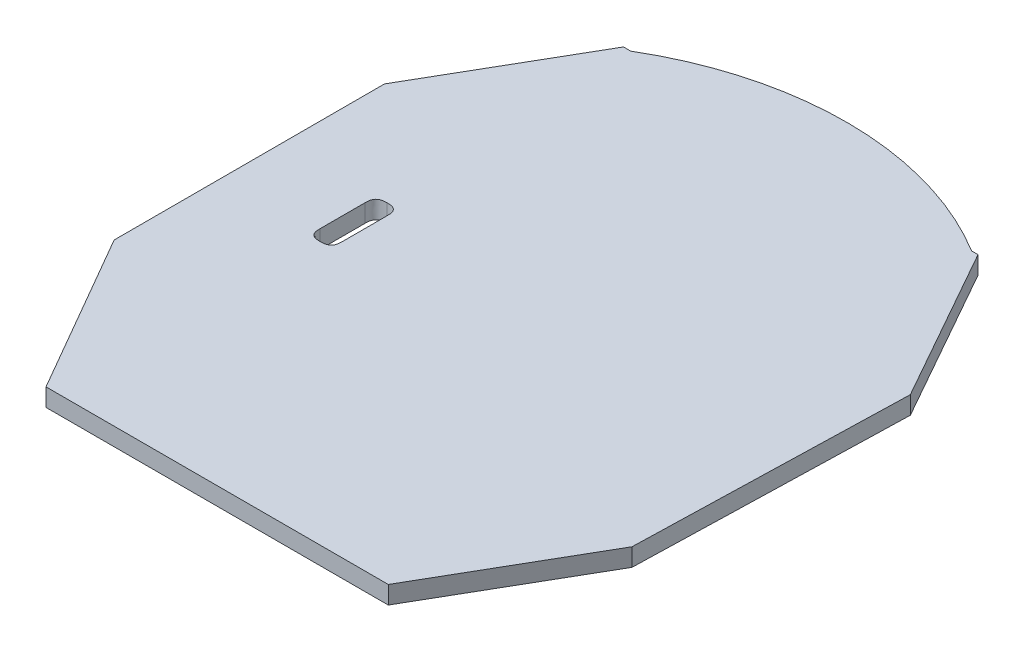
ISO-10303-21;
HEADER;
FILE_DESCRIPTION(('STEP AP214'),'2;1');
FILE_NAME('part.step','',(''),(''),'','','');
FILE_SCHEMA(('AUTOMOTIVE_DESIGN { 1 0 10303 214 1 1 1 1 }'));
ENDSEC;
DATA;
#1=APPLICATION_CONTEXT('core data for automotive mechanical design processes');
#2=APPLICATION_PROTOCOL_DEFINITION('international standard','automotive_design',2000,#1);
#3=PRODUCT_CONTEXT('',#1,'mechanical');
#4=PRODUCT('Part','Part','',(#3));
#5=PRODUCT_RELATED_PRODUCT_CATEGORY('part','',(#4));
#6=PRODUCT_DEFINITION_FORMATION('','',#4);
#7=PRODUCT_DEFINITION_CONTEXT('part definition',#1,'design');
#8=PRODUCT_DEFINITION('design','',#6,#7);
#9=PRODUCT_DEFINITION_SHAPE('','',#8);
#10=(LENGTH_UNIT() NAMED_UNIT(*) SI_UNIT(.MILLI.,.METRE.));
#11=(NAMED_UNIT(*) PLANE_ANGLE_UNIT() SI_UNIT($,.RADIAN.));
#12=(NAMED_UNIT(*) SI_UNIT($,.STERADIAN.) SOLID_ANGLE_UNIT());
#13=UNCERTAINTY_MEASURE_WITH_UNIT(LENGTH_MEASURE(1.E-05),#10,'distance_accuracy_value','');
#14=(GEOMETRIC_REPRESENTATION_CONTEXT(3) GLOBAL_UNCERTAINTY_ASSIGNED_CONTEXT((#13)) GLOBAL_UNIT_ASSIGNED_CONTEXT((#10,
#11,#12)) REPRESENTATION_CONTEXT('',''));
#15=CARTESIAN_POINT('',(0.,0.,0.));
#16=DIRECTION('',(0.,0.,1.));
#17=DIRECTION('',(1.,0.,0.));
#18=AXIS2_PLACEMENT_3D('',#15,#16,#17);
#19=CARTESIAN_POINT('',(-100.196877436676,1.6,22.504325219327));
#20=DIRECTION('',(0.,-1.,0.));
#21=DIRECTION('',(0.,0.,-1.));
#22=AXIS2_PLACEMENT_3D('',#19,#20,#21);
#23=PLANE('',#22);
#24=DIRECTION('',(-0.5,0.,0.866025403784438));
#25=VECTOR('',#24,1.);
#26=CARTESIAN_POINT('',(-123.876706844463,1.6,10.3933670259679));
#27=LINE('',#26,#25);
#28=CARTESIAN_POINT('',(-116.035748856696,1.6,-3.18757058885886));
#29=VERTEX_POINT('',#28);
#30=CARTESIAN_POINT('',(-123.876706844463,1.6,10.3933670259679));
#31=VERTEX_POINT('',#30);
#32=EDGE_CURVE('E165',#29,#31,#27,.T.);
#33=ORIENTED_EDGE('',*,*,#32,.T.);
#34=DIRECTION('',(0.,0.,1.));
#35=VECTOR('',#34,1.);
#36=CARTESIAN_POINT('',(-123.876706844463,1.6,10.3933670259679));
#37=LINE('',#36,#35);
#38=CARTESIAN_POINT('',(-123.876706844463,1.6,34.615283412686));
#39=VERTEX_POINT('',#38);
#40=EDGE_CURVE('E154',#31,#39,#37,.T.);
#41=ORIENTED_EDGE('',*,*,#40,.T.);
#42=DIRECTION('',(0.5,0.,0.866025403784439));
#43=VECTOR('',#42,1.);
#44=CARTESIAN_POINT('',(-123.876706844463,1.6,34.615283412686));
#45=LINE('',#44,#43);
#46=CARTESIAN_POINT('',(-115.532924627112,1.6,49.0671381404276));
#47=VERTEX_POINT('',#46);
#48=EDGE_CURVE('E164',#39,#47,#45,.T.);
#49=ORIENTED_EDGE('',*,*,#48,.T.);
#50=DIRECTION('',(1.,0.,0.));
#51=VECTOR('',#50,1.);
#52=CARTESIAN_POINT('',(-115.532924627112,1.6,49.0671381404276));
#53=LINE('',#52,#51);
#54=CARTESIAN_POINT('',(-84.8608302462487,1.6,49.0671381404276));
#55=VERTEX_POINT('',#54);
#56=EDGE_CURVE('E199',#47,#55,#53,.T.);
#57=ORIENTED_EDGE('',*,*,#56,.T.);
#58=DIRECTION('',(0.5,0.,-0.866025403784439));
#59=VECTOR('',#58,1.);
#60=CARTESIAN_POINT('',(-84.8608302462487,1.6,49.0671381404276));
#61=LINE('',#60,#59);
#62=CARTESIAN_POINT('',(-76.8670067353805,1.6,35.2214296728651));
#63=VERTEX_POINT('',#62);
#64=EDGE_CURVE('E201',#55,#63,#61,.T.);
#65=ORIENTED_EDGE('',*,*,#64,.T.);
#66=DIRECTION('',(0.0275068408451087,0.,-0.999621615265857));
#67=VECTOR('',#66,1.);
#68=CARTESIAN_POINT('',(-76.8670067353805,1.6,35.2214296728651));
#69=LINE('',#68,#67);
#70=CARTESIAN_POINT('',(-76.1989592195925,1.6,10.9440238970924));
#71=VERTEX_POINT('',#70);
#72=EDGE_CURVE('E203',#63,#71,#69,.T.);
#73=ORIENTED_EDGE('',*,*,#72,.T.);
#74=DIRECTION('',(-0.491106131302263,0.,-0.871099746181414));
#75=VECTOR('',#74,1.);
#76=CARTESIAN_POINT('',(-84.0333826596673,1.6,-2.95228860063641));
#77=LINE('',#76,#75);
#78=CARTESIAN_POINT('',(-84.0333826596673,1.6,-2.95228860063641));
#79=VERTEX_POINT('',#78);
#80=EDGE_CURVE('E205',#71,#79,#77,.T.);
#81=ORIENTED_EDGE('',*,*,#80,.T.);
#82=DIRECTION('',(-0.999972975007576,0.,-0.00735181980857839));
#83=VECTOR('',#82,1.);
#84=CARTESIAN_POINT('',(-84.6159522411419,1.6,-2.9565716629751));
#85=LINE('',#84,#83);
#86=CARTESIAN_POINT('',(-84.6159522411419,1.6,-2.9565716629751));
#87=VERTEX_POINT('',#86);
#88=EDGE_CURVE('E207',#79,#87,#85,.T.);
#89=ORIENTED_EDGE('',*,*,#88,.T.);
#90=CARTESIAN_POINT('',(-100.196877436676,1.6,22.504325219327));
#91=DIRECTION('',(0.,1.,0.));
#92=DIRECTION('',(0.,0.,-1.));
#93=AXIS2_PLACEMENT_3D('',#90,#91,#92);
#94=CIRCLE('',#93,29.8500000000009);
#95=CARTESIAN_POINT('',(-115.40176062263,1.6,-3.18290949563525));
#96=VERTEX_POINT('',#95);
#97=EDGE_CURVE('E209',#87,#96,#94,.T.);
#98=ORIENTED_EDGE('',*,*,#97,.T.);
#99=DIRECTION('',(-0.999972975007576,0.,-0.00735181980855867));
#100=VECTOR('',#99,1.);
#101=CARTESIAN_POINT('',(-116.035748856696,1.6,-3.18757058885886));
#102=LINE('',#101,#100);
#103=EDGE_CURVE('E169',#96,#29,#102,.T.);
#104=ORIENTED_EDGE('',*,*,#103,.T.);
#105=EDGE_LOOP('',(#33,#41,#49,#57,#65,#73,#81,#89,#98,#104));
#106=FACE_BOUND('',#105,.T.);
#107=DIRECTION('',(0.,0.,1.));
#108=VECTOR('',#107,1.);
#109=CARTESIAN_POINT('',(-115.526706844463,1.6,19.504325219327));
#110=LINE('',#109,#108);
#111=CARTESIAN_POINT('',(-115.526706844463,1.6,20.504325219327));
#112=VERTEX_POINT('',#111);
#113=CARTESIAN_POINT('',(-115.526706844463,1.6,24.504325219327));
#114=VERTEX_POINT('',#113);
#115=EDGE_CURVE('E189',#112,#114,#110,.T.);
#116=ORIENTED_EDGE('',*,*,#115,.F.);
#117=CARTESIAN_POINT('',(-114.526706844463,1.6,19.504325219327));
#118=CARTESIAN_POINT('',(-114.694904895997,1.6,19.504325219327));
#119=CARTESIAN_POINT('',(-114.863102947531,1.6,19.504325219327));
#120=CARTESIAN_POINT('',(-115.23381362565,1.6,19.576017139163));
#121=CARTESIAN_POINT('',(-115.455014924627,1.6,19.7972184381404));
#122=CARTESIAN_POINT('',(-115.526706844463,1.6,20.1679291162591));
#123=CARTESIAN_POINT('',(-115.526706844463,1.6,20.336127167793));
#124=CARTESIAN_POINT('',(-115.526706844463,1.6,20.504325219327));
#125=B_SPLINE_CURVE_WITH_KNOTS('',5,(#117,#118,#119,#120,#121,#122,#123,#124),.UNSPECIFIED.,.F.,
.F.,(6,2,6),(0.,0.5,1.),.UNSPECIFIED.);
#126=CARTESIAN_POINT('',(-114.526706844463,1.6,19.504325219327));
#127=VERTEX_POINT('',#126);
#128=EDGE_CURVE('E11',#112,#127,#125,.F.);
#129=ORIENTED_EDGE('',*,*,#128,.T.);
#130=CARTESIAN_POINT('',(-113.526706844463,1.6,20.504325219327));
#131=CARTESIAN_POINT('',(-113.526706844463,1.6,20.336127167793));
#132=CARTESIAN_POINT('',(-113.526706844463,1.6,20.1679291162591));
#133=CARTESIAN_POINT('',(-113.598398764299,1.6,19.7972184381404));
#134=CARTESIAN_POINT('',(-113.819600063277,1.6,19.576017139163));
#135=CARTESIAN_POINT('',(-114.190310741395,1.6,19.504325219327));
#136=CARTESIAN_POINT('',(-114.358508792929,1.6,19.504325219327));
#137=CARTESIAN_POINT('',(-114.526706844463,1.6,19.504325219327));
#138=B_SPLINE_CURVE_WITH_KNOTS('',5,(#130,#131,#132,#133,#134,#135,#136,#137),.UNSPECIFIED.,.F.,
.F.,(6,2,6),(0.,0.5,1.),.UNSPECIFIED.);
#139=CARTESIAN_POINT('',(-113.526706844463,1.6,20.504325219327));
#140=VERTEX_POINT('',#139);
#141=EDGE_CURVE('E329',#127,#140,#138,.F.);
#142=ORIENTED_EDGE('',*,*,#141,.T.);
#143=DIRECTION('',(0.,0.,-1.));
#144=VECTOR('',#143,1.);
#145=CARTESIAN_POINT('',(-113.526706844463,1.6,19.504325219327));
#146=LINE('',#145,#144);
#147=CARTESIAN_POINT('',(-113.526706844463,1.6,24.504325219327));
#148=VERTEX_POINT('',#147);
#149=EDGE_CURVE('E191',#148,#140,#146,.T.);
#150=ORIENTED_EDGE('',*,*,#149,.F.);
#151=CARTESIAN_POINT('',(-114.526706844463,1.6,25.504325219327));
#152=CARTESIAN_POINT('',(-114.358508792929,1.6,25.504325219327));
#153=CARTESIAN_POINT('',(-114.190310741395,1.6,25.504325219327));
#154=CARTESIAN_POINT('',(-113.819600063277,1.6,25.4326332994909));
#155=CARTESIAN_POINT('',(-113.598398764299,1.6,25.2114320005135));
#156=CARTESIAN_POINT('',(-113.526706844463,1.6,24.8407213223949));
#157=CARTESIAN_POINT('',(-113.526706844463,1.6,24.6725232708609));
#158=CARTESIAN_POINT('',(-113.526706844463,1.6,24.504325219327));
#159=B_SPLINE_CURVE_WITH_KNOTS('',5,(#151,#152,#153,#154,#155,#156,#157,#158),.UNSPECIFIED.,.F.,
.F.,(6,2,6),(0.,0.5,1.),.UNSPECIFIED.);
#160=CARTESIAN_POINT('',(-114.526706844463,1.6,25.504325219327));
#161=VERTEX_POINT('',#160);
#162=EDGE_CURVE('E444',#148,#161,#159,.F.);
#163=ORIENTED_EDGE('',*,*,#162,.T.);
#164=CARTESIAN_POINT('',(-115.526706844463,1.6,24.504325219327));
#165=CARTESIAN_POINT('',(-115.526706844463,1.6,24.6725232708609));
#166=CARTESIAN_POINT('',(-115.526706844463,1.6,24.8407213223948));
#167=CARTESIAN_POINT('',(-115.455014924627,1.6,25.2114320005135));
#168=CARTESIAN_POINT('',(-115.23381362565,1.6,25.4326332994909));
#169=CARTESIAN_POINT('',(-114.863102947531,1.6,25.504325219327));
#170=CARTESIAN_POINT('',(-114.694904895997,1.6,25.504325219327));
#171=CARTESIAN_POINT('',(-114.526706844463,1.6,25.504325219327));
#172=B_SPLINE_CURVE_WITH_KNOTS('',5,(#164,#165,#166,#167,#168,#169,#170,#171),.UNSPECIFIED.,.F.,
.F.,(6,2,6),(0.,0.5,1.),.UNSPECIFIED.);
#173=EDGE_CURVE('E441',#161,#114,#172,.F.);
#174=ORIENTED_EDGE('',*,*,#173,.T.);
#175=EDGE_LOOP('',(#116,#129,#142,#150,#163,#174));
#176=FACE_BOUND('',#175,.T.);
#177=ADVANCED_FACE('F34',(#106,#176),#23,.F.);
#178=CARTESIAN_POINT('',(-100.196877436676,0.,22.504325219327));
#179=DIRECTION('',(0.,-1.,0.));
#180=DIRECTION('',(0.,0.,-1.));
#181=AXIS2_PLACEMENT_3D('',#178,#179,#180);
#182=PLANE('',#181);
#183=DIRECTION('',(-0.5,0.,0.866025403784438));
#184=VECTOR('',#183,1.);
#185=CARTESIAN_POINT('',(-123.876706844463,0.,10.3933670259679));
#186=LINE('',#185,#184);
#187=CARTESIAN_POINT('',(-116.035748856696,0.,-3.18757058885886));
#188=VERTEX_POINT('',#187);
#189=CARTESIAN_POINT('',(-123.876706844463,0.,10.3933670259679));
#190=VERTEX_POINT('',#189);
#191=EDGE_CURVE('E177',#188,#190,#186,.T.);
#192=ORIENTED_EDGE('',*,*,#191,.F.);
#193=DIRECTION('',(-0.999972975007576,0.,-0.00735181980855867));
#194=VECTOR('',#193,1.);
#195=CARTESIAN_POINT('',(-116.035748856696,0.,-3.18757058885886));
#196=LINE('',#195,#194);
#197=CARTESIAN_POINT('',(-115.40176062263,0.,-3.18290949563525));
#198=VERTEX_POINT('',#197);
#199=EDGE_CURVE('E173',#198,#188,#196,.T.);
#200=ORIENTED_EDGE('',*,*,#199,.F.);
#201=CARTESIAN_POINT('',(-100.196877436676,0.,22.504325219327));
#202=DIRECTION('',(0.,1.,0.));
#203=DIRECTION('',(0.,0.,-1.));
#204=AXIS2_PLACEMENT_3D('',#201,#202,#203);
#205=CIRCLE('',#204,29.8500000000009);
#206=CARTESIAN_POINT('',(-84.6159522411419,0.,-2.9565716629751));
#207=VERTEX_POINT('',#206);
#208=EDGE_CURVE('E228',#207,#198,#205,.T.);
#209=ORIENTED_EDGE('',*,*,#208,.F.);
#210=DIRECTION('',(-0.999972975007576,0.,-0.00735181980857839));
#211=VECTOR('',#210,1.);
#212=CARTESIAN_POINT('',(-84.6159522411419,0.,-2.9565716629751));
#213=LINE('',#212,#211);
#214=CARTESIAN_POINT('',(-84.0333826596673,0.,-2.95228860063641));
#215=VERTEX_POINT('',#214);
#216=EDGE_CURVE('E226',#215,#207,#213,.T.);
#217=ORIENTED_EDGE('',*,*,#216,.F.);
#218=DIRECTION('',(-0.491106131302263,0.,-0.871099746181414));
#219=VECTOR('',#218,1.);
#220=CARTESIAN_POINT('',(-84.0333826596673,0.,-2.95228860063641));
#221=LINE('',#220,#219);
#222=CARTESIAN_POINT('',(-76.1989592195925,0.,10.9440238970924));
#223=VERTEX_POINT('',#222);
#224=EDGE_CURVE('E224',#223,#215,#221,.T.);
#225=ORIENTED_EDGE('',*,*,#224,.F.);
#226=DIRECTION('',(0.0275068408451087,0.,-0.999621615265857));
#227=VECTOR('',#226,1.);
#228=CARTESIAN_POINT('',(-76.8670067353805,0.,35.2214296728651));
#229=LINE('',#228,#227);
#230=CARTESIAN_POINT('',(-76.8670067353805,0.,35.2214296728651));
#231=VERTEX_POINT('',#230);
#232=EDGE_CURVE('E222',#231,#223,#229,.T.);
#233=ORIENTED_EDGE('',*,*,#232,.F.);
#234=DIRECTION('',(0.5,0.,-0.866025403784439));
#235=VECTOR('',#234,1.);
#236=CARTESIAN_POINT('',(-84.8608302462487,0.,49.0671381404276));
#237=LINE('',#236,#235);
#238=CARTESIAN_POINT('',(-84.8608302462487,0.,49.0671381404276));
#239=VERTEX_POINT('',#238);
#240=EDGE_CURVE('E220',#239,#231,#237,.T.);
#241=ORIENTED_EDGE('',*,*,#240,.F.);
#242=DIRECTION('',(1.,0.,0.));
#243=VECTOR('',#242,1.);
#244=CARTESIAN_POINT('',(-115.532924627112,0.,49.0671381404276));
#245=LINE('',#244,#243);
#246=CARTESIAN_POINT('',(-115.532924627112,0.,49.0671381404276));
#247=VERTEX_POINT('',#246);
#248=EDGE_CURVE('E218',#247,#239,#245,.T.);
#249=ORIENTED_EDGE('',*,*,#248,.F.);
#250=DIRECTION('',(0.5,0.,0.866025403784439));
#251=VECTOR('',#250,1.);
#252=CARTESIAN_POINT('',(-123.876706844463,0.,34.615283412686));
#253=LINE('',#252,#251);
#254=CARTESIAN_POINT('',(-123.876706844463,0.,34.615283412686));
#255=VERTEX_POINT('',#254);
#256=EDGE_CURVE('E216',#255,#247,#253,.T.);
#257=ORIENTED_EDGE('',*,*,#256,.F.);
#258=DIRECTION('',(0.,0.,1.));
#259=VECTOR('',#258,1.);
#260=CARTESIAN_POINT('',(-123.876706844463,0.,10.3933670259679));
#261=LINE('',#260,#259);
#262=EDGE_CURVE('E214',#190,#255,#261,.T.);
#263=ORIENTED_EDGE('',*,*,#262,.F.);
#264=EDGE_LOOP('',(#192,#200,#209,#217,#225,#233,#241,#249,#257,#263));
#265=FACE_BOUND('',#264,.T.);
#266=CARTESIAN_POINT('',(-114.526706844463,0.,19.504325219327));
#267=CARTESIAN_POINT('',(-114.358508792929,0.,19.504325219327));
#268=CARTESIAN_POINT('',(-114.190310741395,0.,19.504325219327));
#269=CARTESIAN_POINT('',(-113.819600063277,0.,19.576017139163));
#270=CARTESIAN_POINT('',(-113.598398764299,0.,19.7972184381404));
#271=CARTESIAN_POINT('',(-113.526706844463,0.,20.1679291162591));
#272=CARTESIAN_POINT('',(-113.526706844463,0.,20.336127167793));
#273=CARTESIAN_POINT('',(-113.526706844463,0.,20.504325219327));
#274=B_SPLINE_CURVE_WITH_KNOTS('',5,(#266,#267,#268,#269,#270,#271,#272,#273),.UNSPECIFIED.,.F.,
.F.,(6,2,6),(0.,0.5,1.),.UNSPECIFIED.);
#275=CARTESIAN_POINT('',(-113.526706844463,0.,20.504325219327));
#276=VERTEX_POINT('',#275);
#277=CARTESIAN_POINT('',(-114.526706844463,0.,19.504325219327));
#278=VERTEX_POINT('',#277);
#279=EDGE_CURVE('E62',#276,#278,#274,.F.);
#280=ORIENTED_EDGE('',*,*,#279,.T.);
#281=CARTESIAN_POINT('',(-115.526706844463,0.,20.504325219327));
#282=CARTESIAN_POINT('',(-115.526706844463,0.,20.336127167793));
#283=CARTESIAN_POINT('',(-115.526706844463,0.,20.1679291162591));
#284=CARTESIAN_POINT('',(-115.455014924627,0.,19.7972184381404));
#285=CARTESIAN_POINT('',(-115.23381362565,0.,19.576017139163));
#286=CARTESIAN_POINT('',(-114.863102947531,0.,19.504325219327));
#287=CARTESIAN_POINT('',(-114.694904895997,0.,19.504325219327));
#288=CARTESIAN_POINT('',(-114.526706844463,0.,19.504325219327));
#289=B_SPLINE_CURVE_WITH_KNOTS('',5,(#281,#282,#283,#284,#285,#286,#287,#288),.UNSPECIFIED.,.F.,
.F.,(6,2,6),(0.,0.5,1.),.UNSPECIFIED.);
#290=CARTESIAN_POINT('',(-115.526706844463,0.,20.504325219327));
#291=VERTEX_POINT('',#290);
#292=EDGE_CURVE('E48',#278,#291,#289,.F.);
#293=ORIENTED_EDGE('',*,*,#292,.T.);
#294=DIRECTION('',(0.,0.,1.));
#295=VECTOR('',#294,1.);
#296=CARTESIAN_POINT('',(-115.526706844463,0.,19.504325219327));
#297=LINE('',#296,#295);
#298=CARTESIAN_POINT('',(-115.526706844463,0.,24.504325219327));
#299=VERTEX_POINT('',#298);
#300=EDGE_CURVE('E190',#291,#299,#297,.T.);
#301=ORIENTED_EDGE('',*,*,#300,.T.);
#302=CARTESIAN_POINT('',(-114.526706844463,0.,25.504325219327));
#303=CARTESIAN_POINT('',(-114.694904895997,0.,25.504325219327));
#304=CARTESIAN_POINT('',(-114.863102947531,0.,25.504325219327));
#305=CARTESIAN_POINT('',(-115.23381362565,0.,25.4326332994909));
#306=CARTESIAN_POINT('',(-115.455014924627,0.,25.2114320005135));
#307=CARTESIAN_POINT('',(-115.526706844463,0.,24.8407213223948));
#308=CARTESIAN_POINT('',(-115.526706844463,0.,24.6725232708609));
#309=CARTESIAN_POINT('',(-115.526706844463,0.,24.504325219327));
#310=B_SPLINE_CURVE_WITH_KNOTS('',5,(#302,#303,#304,#305,#306,#307,#308,#309),.UNSPECIFIED.,.F.,
.F.,(6,2,6),(0.,0.5,1.),.UNSPECIFIED.);
#311=CARTESIAN_POINT('',(-114.526706844463,0.,25.504325219327));
#312=VERTEX_POINT('',#311);
#313=EDGE_CURVE('E442',#299,#312,#310,.F.);
#314=ORIENTED_EDGE('',*,*,#313,.T.);
#315=CARTESIAN_POINT('',(-113.526706844463,0.,24.504325219327));
#316=CARTESIAN_POINT('',(-113.526706844463,0.,24.6725232708609));
#317=CARTESIAN_POINT('',(-113.526706844463,0.,24.8407213223949));
#318=CARTESIAN_POINT('',(-113.598398764299,0.,25.2114320005135));
#319=CARTESIAN_POINT('',(-113.819600063277,0.,25.4326332994909));
#320=CARTESIAN_POINT('',(-114.190310741395,0.,25.504325219327));
#321=CARTESIAN_POINT('',(-114.358508792929,0.,25.504325219327));
#322=CARTESIAN_POINT('',(-114.526706844463,0.,25.504325219327));
#323=B_SPLINE_CURVE_WITH_KNOTS('',5,(#315,#316,#317,#318,#319,#320,#321,#322),.UNSPECIFIED.,.F.,
.F.,(6,2,6),(0.,0.5,1.),.UNSPECIFIED.);
#324=CARTESIAN_POINT('',(-113.526706844463,0.,24.504325219327));
#325=VERTEX_POINT('',#324);
#326=EDGE_CURVE('E446',#312,#325,#323,.F.);
#327=ORIENTED_EDGE('',*,*,#326,.T.);
#328=DIRECTION('',(0.,0.,-1.));
#329=VECTOR('',#328,1.);
#330=CARTESIAN_POINT('',(-113.526706844463,0.,19.504325219327));
#331=LINE('',#330,#329);
#332=EDGE_CURVE('E186',#325,#276,#331,.T.);
#333=ORIENTED_EDGE('',*,*,#332,.T.);
#334=EDGE_LOOP('',(#280,#293,#301,#314,#327,#333));
#335=FACE_BOUND('',#334,.T.);
#336=ADVANCED_FACE('F260',(#265,#335),#182,.T.);
#337=CARTESIAN_POINT('',(-123.876706844463,1.6,10.3933670259679));
#338=DIRECTION('',(0.866025403784438,0.,0.5));
#339=DIRECTION('',(0.5,0.,-0.866025403784438));
#340=AXIS2_PLACEMENT_3D('',#337,#338,#339);
#341=PLANE('',#340);
#342=ORIENTED_EDGE('',*,*,#191,.T.);
#343=DIRECTION('',(0.,-1.,0.));
#344=VECTOR('',#343,1.);
#345=CARTESIAN_POINT('',(-123.876706844463,1.6,10.3933670259679));
#346=LINE('',#345,#344);
#347=EDGE_CURVE('E158',#31,#190,#346,.T.);
#348=ORIENTED_EDGE('',*,*,#347,.F.);
#349=ORIENTED_EDGE('',*,*,#32,.F.);
#350=DIRECTION('',(0.,-1.,0.));
#351=VECTOR('',#350,1.);
#352=CARTESIAN_POINT('',(-116.035748856696,1.6,-3.18757058885886));
#353=LINE('',#352,#351);
#354=EDGE_CURVE('E212',#29,#188,#353,.T.);
#355=ORIENTED_EDGE('',*,*,#354,.T.);
#356=EDGE_LOOP('',(#342,#348,#349,#355));
#357=FACE_BOUND('',#356,.T.);
#358=ADVANCED_FACE('F175',(#357),#341,.F.);
#359=CARTESIAN_POINT('',(-123.876706844463,1.6,10.3933670259679));
#360=DIRECTION('',(1.,0.,0.));
#361=DIRECTION('',(0.,0.,-1.));
#362=AXIS2_PLACEMENT_3D('',#359,#360,#361);
#363=PLANE('',#362);
#364=ORIENTED_EDGE('',*,*,#262,.T.);
#365=DIRECTION('',(0.,-1.,0.));
#366=VECTOR('',#365,1.);
#367=CARTESIAN_POINT('',(-123.876706844463,1.6,34.615283412686));
#368=LINE('',#367,#366);
#369=EDGE_CURVE('E161',#39,#255,#368,.T.);
#370=ORIENTED_EDGE('',*,*,#369,.F.);
#371=ORIENTED_EDGE('',*,*,#40,.F.);
#372=ORIENTED_EDGE('',*,*,#347,.T.);
#373=EDGE_LOOP('',(#364,#370,#371,#372));
#374=FACE_BOUND('',#373,.T.);
#375=ADVANCED_FACE('F156',(#374),#363,.F.);
#376=CARTESIAN_POINT('',(-123.876706844463,1.6,34.615283412686));
#377=DIRECTION('',(0.866025403784439,0.,-0.5));
#378=DIRECTION('',(-0.5,0.,-0.866025403784439));
#379=AXIS2_PLACEMENT_3D('',#376,#377,#378);
#380=PLANE('',#379);
#381=ORIENTED_EDGE('',*,*,#256,.T.);
#382=DIRECTION('',(0.,-1.,0.));
#383=VECTOR('',#382,1.);
#384=CARTESIAN_POINT('',(-115.532924627112,1.6,49.0671381404276));
#385=LINE('',#384,#383);
#386=EDGE_CURVE('E182',#47,#247,#385,.T.);
#387=ORIENTED_EDGE('',*,*,#386,.F.);
#388=ORIENTED_EDGE('',*,*,#48,.F.);
#389=ORIENTED_EDGE('',*,*,#369,.T.);
#390=EDGE_LOOP('',(#381,#387,#388,#389));
#391=FACE_BOUND('',#390,.T.);
#392=ADVANCED_FACE('F273',(#391),#380,.F.);
#393=CARTESIAN_POINT('',(-115.532924627112,1.6,49.0671381404276));
#394=DIRECTION('',(0.,0.,-1.));
#395=DIRECTION('',(-1.,0.,0.));
#396=AXIS2_PLACEMENT_3D('',#393,#394,#395);
#397=PLANE('',#396);
#398=ORIENTED_EDGE('',*,*,#248,.T.);
#399=DIRECTION('',(0.,-1.,0.));
#400=VECTOR('',#399,1.);
#401=CARTESIAN_POINT('',(-84.8608302462487,1.6,49.0671381404276));
#402=LINE('',#401,#400);
#403=EDGE_CURVE('E247',#55,#239,#402,.T.);
#404=ORIENTED_EDGE('',*,*,#403,.F.);
#405=ORIENTED_EDGE('',*,*,#56,.F.);
#406=ORIENTED_EDGE('',*,*,#386,.T.);
#407=EDGE_LOOP('',(#398,#404,#405,#406));
#408=FACE_BOUND('',#407,.T.);
#409=ADVANCED_FACE('F254',(#408),#397,.F.);
#410=CARTESIAN_POINT('',(-84.8608302462487,1.6,49.0671381404276));
#411=DIRECTION('',(-0.866025403784439,0.,-0.5));
#412=DIRECTION('',(-0.5,0.,0.866025403784439));
#413=AXIS2_PLACEMENT_3D('',#410,#411,#412);
#414=PLANE('',#413);
#415=ORIENTED_EDGE('',*,*,#240,.T.);
#416=DIRECTION('',(0.,-1.,0.));
#417=VECTOR('',#416,1.);
#418=CARTESIAN_POINT('',(-76.8670067353805,1.6,35.2214296728651));
#419=LINE('',#418,#417);
#420=EDGE_CURVE('E244',#63,#231,#419,.T.);
#421=ORIENTED_EDGE('',*,*,#420,.F.);
#422=ORIENTED_EDGE('',*,*,#64,.F.);
#423=ORIENTED_EDGE('',*,*,#403,.T.);
#424=EDGE_LOOP('',(#415,#421,#422,#423));
#425=FACE_BOUND('',#424,.T.);
#426=ADVANCED_FACE('F265',(#425),#414,.F.);
#427=CARTESIAN_POINT('',(-76.8670067353805,1.6,35.2214296728651));
#428=DIRECTION('',(-0.999621615265857,0.,-0.0275068408451087));
#429=DIRECTION('',(-0.0275068408451087,0.,0.999621615265857));
#430=AXIS2_PLACEMENT_3D('',#427,#428,#429);
#431=PLANE('',#430);
#432=ORIENTED_EDGE('',*,*,#232,.T.);
#433=DIRECTION('',(0.,-1.,0.));
#434=VECTOR('',#433,1.);
#435=CARTESIAN_POINT('',(-76.1989592195925,1.6,10.9440238970924));
#436=LINE('',#435,#434);
#437=EDGE_CURVE('E241',#71,#223,#436,.T.);
#438=ORIENTED_EDGE('',*,*,#437,.F.);
#439=ORIENTED_EDGE('',*,*,#72,.F.);
#440=ORIENTED_EDGE('',*,*,#420,.T.);
#441=EDGE_LOOP('',(#432,#438,#439,#440));
#442=FACE_BOUND('',#441,.T.);
#443=ADVANCED_FACE('F269',(#442),#431,.F.);
#444=CARTESIAN_POINT('',(-84.0333826596673,1.6,-2.95228860063641));
#445=DIRECTION('',(-0.871099746181415,0.,0.491106131302263));
#446=DIRECTION('',(0.491106131302263,0.,0.871099746181415));
#447=AXIS2_PLACEMENT_3D('',#444,#445,#446);
#448=PLANE('',#447);
#449=ORIENTED_EDGE('',*,*,#224,.T.);
#450=DIRECTION('',(0.,-1.,0.));
#451=VECTOR('',#450,1.);
#452=CARTESIAN_POINT('',(-84.0333826596673,1.6,-2.95228860063641));
#453=LINE('',#452,#451);
#454=EDGE_CURVE('E238',#79,#215,#453,.T.);
#455=ORIENTED_EDGE('',*,*,#454,.F.);
#456=ORIENTED_EDGE('',*,*,#80,.F.);
#457=ORIENTED_EDGE('',*,*,#437,.T.);
#458=EDGE_LOOP('',(#449,#455,#456,#457));
#459=FACE_BOUND('',#458,.T.);
#460=ADVANCED_FACE('F597',(#459),#448,.F.);
#461=CARTESIAN_POINT('',(-84.6159522411419,1.6,-2.9565716629751));
#462=DIRECTION('',(-0.00735181980857839,0.,0.999972975007576));
#463=DIRECTION('',(0.999972975007576,0.,0.0073518198085784));
#464=AXIS2_PLACEMENT_3D('',#461,#462,#463);
#465=PLANE('',#464);
#466=ORIENTED_EDGE('',*,*,#216,.T.);
#467=DIRECTION('',(0.,-1.,0.));
#468=VECTOR('',#467,1.);
#469=CARTESIAN_POINT('',(-84.6159522411419,1.6,-2.9565716629751));
#470=LINE('',#469,#468);
#471=EDGE_CURVE('E235',#87,#207,#470,.T.);
#472=ORIENTED_EDGE('',*,*,#471,.F.);
#473=ORIENTED_EDGE('',*,*,#88,.F.);
#474=ORIENTED_EDGE('',*,*,#454,.T.);
#475=EDGE_LOOP('',(#466,#472,#473,#474));
#476=FACE_BOUND('',#475,.T.);
#477=ADVANCED_FACE('F591',(#476),#465,.F.);
#478=CARTESIAN_POINT('',(-100.196877436676,1.6,22.504325219327));
#479=DIRECTION('',(0.,-1.,0.));
#480=DIRECTION('',(0.,0.,-1.));
#481=AXIS2_PLACEMENT_3D('',#478,#479,#480);
#482=CYLINDRICAL_SURFACE('',#481,29.8500000000009);
#483=ORIENTED_EDGE('',*,*,#208,.T.);
#484=DIRECTION('',(0.,-1.,0.));
#485=VECTOR('',#484,1.);
#486=CARTESIAN_POINT('',(-115.40176062263,1.6,-3.18290949563525));
#487=LINE('',#486,#485);
#488=EDGE_CURVE('E232',#96,#198,#487,.T.);
#489=ORIENTED_EDGE('',*,*,#488,.F.);
#490=ORIENTED_EDGE('',*,*,#97,.F.);
#491=ORIENTED_EDGE('',*,*,#471,.T.);
#492=EDGE_LOOP('',(#483,#489,#490,#491));
#493=FACE_BOUND('',#492,.T.);
#494=ADVANCED_FACE('F586',(#493),#482,.T.);
#495=CARTESIAN_POINT('',(-116.035748856696,1.6,-3.18757058885886));
#496=DIRECTION('',(-0.00735181980855866,0.,0.999972975007576));
#497=DIRECTION('',(0.999972975007576,0.,0.00735181980855867));
#498=AXIS2_PLACEMENT_3D('',#495,#496,#497);
#499=PLANE('',#498);
#500=ORIENTED_EDGE('',*,*,#199,.T.);
#501=ORIENTED_EDGE('',*,*,#354,.F.);
#502=ORIENTED_EDGE('',*,*,#103,.F.);
#503=ORIENTED_EDGE('',*,*,#488,.T.);
#504=EDGE_LOOP('',(#500,#501,#502,#503));
#505=FACE_BOUND('',#504,.T.);
#506=ADVANCED_FACE('F545',(#505),#499,.F.);
#507=CARTESIAN_POINT('',(-115.526706844463,1.6,19.504325219327));
#508=DIRECTION('',(1.,0.,0.));
#509=DIRECTION('',(0.,0.,-1.));
#510=AXIS2_PLACEMENT_3D('',#507,#508,#509);
#511=PLANE('',#510);
#512=ORIENTED_EDGE('',*,*,#115,.T.);
#513=CARTESIAN_POINT('',(-115.526706844463,-0.08,24.504325219327));
#514=CARTESIAN_POINT('',(-115.526706844463,0.506666666666667,24.504325219327));
#515=CARTESIAN_POINT('',(-115.526706844463,1.09333333333344,24.504325219327));
#516=CARTESIAN_POINT('',(-115.526706844463,1.68,24.504325219327));
#517=B_SPLINE_CURVE_WITH_KNOTS('',3,(#513,#514,#515,#516),.UNSPECIFIED.,.F.,.F.,(4,4),(-0.00168,
8.E-05),.UNSPECIFIED.);
#518=EDGE_CURVE('E358',#114,#299,#517,.F.);
#519=ORIENTED_EDGE('',*,*,#518,.T.);
#520=ORIENTED_EDGE('',*,*,#300,.F.);
#521=CARTESIAN_POINT('',(-115.526706844463,1.68,20.504325219327));
#522=CARTESIAN_POINT('',(-115.526706844463,1.09333333333344,20.504325219327));
#523=CARTESIAN_POINT('',(-115.526706844463,0.506666666666667,20.504325219327));
#524=CARTESIAN_POINT('',(-115.526706844463,-0.08,20.504325219327));
#525=B_SPLINE_CURVE_WITH_KNOTS('',3,(#521,#522,#523,#524),.UNSPECIFIED.,.F.,.F.,(4,4),(-0.00168,
8.E-05),.UNSPECIFIED.);
#526=EDGE_CURVE('E355',#291,#112,#525,.F.);
#527=ORIENTED_EDGE('',*,*,#526,.T.);
#528=EDGE_LOOP('',(#512,#519,#520,#527));
#529=FACE_BOUND('',#528,.T.);
#530=ADVANCED_FACE('F290',(#529),#511,.T.);
#531=CARTESIAN_POINT('',(-113.526706844463,1.6,19.504325219327));
#532=DIRECTION('',(-1.,0.,0.));
#533=DIRECTION('',(0.,0.,1.));
#534=AXIS2_PLACEMENT_3D('',#531,#532,#533);
#535=PLANE('',#534);
#536=ORIENTED_EDGE('',*,*,#332,.F.);
#537=CARTESIAN_POINT('',(-113.526706844463,1.68,24.504325219327));
#538=CARTESIAN_POINT('',(-113.526706844463,1.09333333333344,24.504325219327));
#539=CARTESIAN_POINT('',(-113.526706844463,0.506666666666667,24.504325219327));
#540=CARTESIAN_POINT('',(-113.526706844463,-0.08,24.504325219327));
#541=B_SPLINE_CURVE_WITH_KNOTS('',3,(#537,#538,#539,#540),.UNSPECIFIED.,.F.,.F.,(4,4),(-0.00168,
8.E-05),.UNSPECIFIED.);
#542=EDGE_CURVE('E181',#325,#148,#541,.F.);
#543=ORIENTED_EDGE('',*,*,#542,.T.);
#544=ORIENTED_EDGE('',*,*,#149,.T.);
#545=CARTESIAN_POINT('',(-113.526706844463,-0.08,20.504325219327));
#546=CARTESIAN_POINT('',(-113.526706844463,0.506666666666667,20.504325219327));
#547=CARTESIAN_POINT('',(-113.526706844463,1.09333333333344,20.504325219327));
#548=CARTESIAN_POINT('',(-113.526706844463,1.68,20.504325219327));
#549=B_SPLINE_CURVE_WITH_KNOTS('',3,(#545,#546,#547,#548),.UNSPECIFIED.,.F.,.F.,(4,4),(-0.00168,
8.E-05),.UNSPECIFIED.);
#550=EDGE_CURVE('E178',#140,#276,#549,.F.);
#551=ORIENTED_EDGE('',*,*,#550,.T.);
#552=EDGE_LOOP('',(#536,#543,#544,#551));
#553=FACE_BOUND('',#552,.T.);
#554=ADVANCED_FACE('F457',(#553),#535,.T.);
#555=CARTESIAN_POINT('',(-114.526706844463,-0.08,25.504325219327));
#556=CARTESIAN_POINT('',(-114.526706844463,0.506666666666667,25.504325219327));
#557=CARTESIAN_POINT('',(-114.526706844463,1.09333333333344,25.504325219327));
#558=CARTESIAN_POINT('',(-114.526706844463,1.68,25.504325219327));
#559=CARTESIAN_POINT('',(-114.694904895997,-0.08,25.504325219327));
#560=CARTESIAN_POINT('',(-114.694904895997,0.506666666666667,25.504325219327));
#561=CARTESIAN_POINT('',(-114.694904895997,1.09333333333344,25.504325219327));
#562=CARTESIAN_POINT('',(-114.694904895997,1.68,25.504325219327));
#563=CARTESIAN_POINT('',(-114.863102947531,-0.08,25.504325219327));
#564=CARTESIAN_POINT('',(-114.863102947531,0.506666666666667,25.504325219327));
#565=CARTESIAN_POINT('',(-114.863102947531,1.09333333333344,25.504325219327));
#566=CARTESIAN_POINT('',(-114.863102947531,1.68,25.504325219327));
#567=CARTESIAN_POINT('',(-115.23381362565,-0.08,25.4326332994909));
#568=CARTESIAN_POINT('',(-115.23381362565,0.506666666666667,25.4326332994909));
#569=CARTESIAN_POINT('',(-115.23381362565,1.09333333333344,25.4326332994909));
#570=CARTESIAN_POINT('',(-115.23381362565,1.68,25.4326332994909));
#571=CARTESIAN_POINT('',(-115.455014924627,-0.08,25.2114320005135));
#572=CARTESIAN_POINT('',(-115.455014924627,0.506666666666667,25.2114320005135));
#573=CARTESIAN_POINT('',(-115.455014924627,1.09333333333344,25.2114320005135));
#574=CARTESIAN_POINT('',(-115.455014924627,1.68,25.2114320005135));
#575=CARTESIAN_POINT('',(-115.526706844463,-0.08,24.8407213223948));
#576=CARTESIAN_POINT('',(-115.526706844463,0.506666666666667,24.8407213223948));
#577=CARTESIAN_POINT('',(-115.526706844463,1.09333333333344,24.8407213223948));
#578=CARTESIAN_POINT('',(-115.526706844463,1.68,24.8407213223948));
#579=CARTESIAN_POINT('',(-115.526706844463,-0.08,24.6725232708609));
#580=CARTESIAN_POINT('',(-115.526706844463,0.506666666666667,24.6725232708609));
#581=CARTESIAN_POINT('',(-115.526706844463,1.09333333333344,24.6725232708609));
#582=CARTESIAN_POINT('',(-115.526706844463,1.68,24.6725232708609));
#583=CARTESIAN_POINT('',(-115.526706844463,-0.08,24.504325219327));
#584=CARTESIAN_POINT('',(-115.526706844463,0.506666666666667,24.504325219327));
#585=CARTESIAN_POINT('',(-115.526706844463,1.09333333333344,24.504325219327));
#586=CARTESIAN_POINT('',(-115.526706844463,1.68,24.504325219327));
#587=B_SPLINE_SURFACE_WITH_KNOTS('',5,3,((#555,#556,#557,#558),(#559,#560,#561,#562),(#563,#564,
#565,#566),(#567,#568,#569,#570),(#571,#572,#573,#574),(#575,#576,#577,#578),(#579,#580,#581,
#582),(#583,#584,#585,#586)),.UNSPECIFIED.,.F.,.F.,.F.,(6,2,6),(4,4),(0.,0.5,1.),(-0.00168,
8.E-05),.UNSPECIFIED.);
#588=CARTESIAN_POINT('',(-114.526706844463,-0.08,25.504325219327));
#589=CARTESIAN_POINT('',(-114.526706844463,0.506666666666667,25.504325219327));
#590=CARTESIAN_POINT('',(-114.526706844463,1.09333333333344,25.504325219327));
#591=CARTESIAN_POINT('',(-114.526706844463,1.68,25.504325219327));
#592=B_SPLINE_CURVE_WITH_KNOTS('',3,(#588,#589,#590,#591),.UNSPECIFIED.,.F.,.F.,(4,4),(-0.00168,
8.E-05),.UNSPECIFIED.);
#593=EDGE_CURVE('E360',#312,#161,#592,.T.);
#594=ORIENTED_EDGE('',*,*,#518,.F.);
#595=ORIENTED_EDGE('',*,*,#173,.F.);
#596=ORIENTED_EDGE('',*,*,#593,.F.);
#597=ORIENTED_EDGE('',*,*,#313,.F.);
#598=EDGE_LOOP('',(#594,#595,#596,#597));
#599=FACE_BOUND('',#598,.T.);
#600=ADVANCED_FACE('F411',(#599),#587,.T.);
#601=CARTESIAN_POINT('',(-113.526706844463,-0.08,24.504325219327));
#602=CARTESIAN_POINT('',(-113.526706844463,0.506666666666667,24.504325219327));
#603=CARTESIAN_POINT('',(-113.526706844463,1.09333333333344,24.504325219327));
#604=CARTESIAN_POINT('',(-113.526706844463,1.68,24.504325219327));
#605=CARTESIAN_POINT('',(-113.526706844463,-0.08,24.6725232708609));
#606=CARTESIAN_POINT('',(-113.526706844463,0.506666666666667,24.6725232708609));
#607=CARTESIAN_POINT('',(-113.526706844463,1.09333333333344,24.6725232708609));
#608=CARTESIAN_POINT('',(-113.526706844463,1.68,24.6725232708609));
#609=CARTESIAN_POINT('',(-113.526706844463,-0.08,24.8407213223949));
#610=CARTESIAN_POINT('',(-113.526706844463,0.506666666666667,24.8407213223949));
#611=CARTESIAN_POINT('',(-113.526706844463,1.09333333333344,24.8407213223949));
#612=CARTESIAN_POINT('',(-113.526706844463,1.68,24.8407213223949));
#613=CARTESIAN_POINT('',(-113.598398764299,-0.08,25.2114320005135));
#614=CARTESIAN_POINT('',(-113.598398764299,0.506666666666667,25.2114320005135));
#615=CARTESIAN_POINT('',(-113.598398764299,1.09333333333344,25.2114320005135));
#616=CARTESIAN_POINT('',(-113.598398764299,1.68,25.2114320005135));
#617=CARTESIAN_POINT('',(-113.819600063277,-0.08,25.4326332994909));
#618=CARTESIAN_POINT('',(-113.819600063277,0.506666666666667,25.4326332994909));
#619=CARTESIAN_POINT('',(-113.819600063277,1.09333333333344,25.4326332994909));
#620=CARTESIAN_POINT('',(-113.819600063277,1.68,25.4326332994909));
#621=CARTESIAN_POINT('',(-114.190310741395,-0.08,25.504325219327));
#622=CARTESIAN_POINT('',(-114.190310741395,0.506666666666667,25.504325219327));
#623=CARTESIAN_POINT('',(-114.190310741395,1.09333333333344,25.504325219327));
#624=CARTESIAN_POINT('',(-114.190310741395,1.68,25.504325219327));
#625=CARTESIAN_POINT('',(-114.358508792929,-0.08,25.504325219327));
#626=CARTESIAN_POINT('',(-114.358508792929,0.506666666666667,25.504325219327));
#627=CARTESIAN_POINT('',(-114.358508792929,1.09333333333344,25.504325219327));
#628=CARTESIAN_POINT('',(-114.358508792929,1.68,25.504325219327));
#629=CARTESIAN_POINT('',(-114.526706844463,-0.08,25.504325219327));
#630=CARTESIAN_POINT('',(-114.526706844463,0.506666666666667,25.504325219327));
#631=CARTESIAN_POINT('',(-114.526706844463,1.09333333333344,25.504325219327));
#632=CARTESIAN_POINT('',(-114.526706844463,1.68,25.504325219327));
#633=B_SPLINE_SURFACE_WITH_KNOTS('',5,3,((#601,#602,#603,#604),(#605,#606,#607,#608),(#609,#610,
#611,#612),(#613,#614,#615,#616),(#617,#618,#619,#620),(#621,#622,#623,#624),(#625,#626,#627,
#628),(#629,#630,#631,#632)),.UNSPECIFIED.,.F.,.F.,.F.,(6,2,6),(4,4),(0.,0.5,1.),(-0.00168,
8.E-05),.UNSPECIFIED.);
#634=ORIENTED_EDGE('',*,*,#162,.F.);
#635=ORIENTED_EDGE('',*,*,#542,.F.);
#636=ORIENTED_EDGE('',*,*,#326,.F.);
#637=ORIENTED_EDGE('',*,*,#593,.T.);
#638=EDGE_LOOP('',(#634,#635,#636,#637));
#639=FACE_BOUND('',#638,.T.);
#640=ADVANCED_FACE('F460',(#639),#633,.T.);
#641=CARTESIAN_POINT('',(-115.526706844463,-0.08,20.504325219327));
#642=CARTESIAN_POINT('',(-115.526706844463,0.506666666666667,20.504325219327));
#643=CARTESIAN_POINT('',(-115.526706844463,1.09333333333344,20.504325219327));
#644=CARTESIAN_POINT('',(-115.526706844463,1.68,20.504325219327));
#645=CARTESIAN_POINT('',(-115.526706844463,-0.08,20.336127167793));
#646=CARTESIAN_POINT('',(-115.526706844463,0.506666666666667,20.336127167793));
#647=CARTESIAN_POINT('',(-115.526706844463,1.09333333333344,20.336127167793));
#648=CARTESIAN_POINT('',(-115.526706844463,1.68,20.336127167793));
#649=CARTESIAN_POINT('',(-115.526706844463,-0.08,20.1679291162591));
#650=CARTESIAN_POINT('',(-115.526706844463,0.506666666666667,20.1679291162591));
#651=CARTESIAN_POINT('',(-115.526706844463,1.09333333333344,20.1679291162591));
#652=CARTESIAN_POINT('',(-115.526706844463,1.68,20.1679291162591));
#653=CARTESIAN_POINT('',(-115.455014924627,-0.08,19.7972184381404));
#654=CARTESIAN_POINT('',(-115.455014924627,0.506666666666667,19.7972184381404));
#655=CARTESIAN_POINT('',(-115.455014924627,1.09333333333344,19.7972184381404));
#656=CARTESIAN_POINT('',(-115.455014924627,1.68,19.7972184381404));
#657=CARTESIAN_POINT('',(-115.23381362565,-0.08,19.576017139163));
#658=CARTESIAN_POINT('',(-115.23381362565,0.506666666666667,19.576017139163));
#659=CARTESIAN_POINT('',(-115.23381362565,1.09333333333344,19.576017139163));
#660=CARTESIAN_POINT('',(-115.23381362565,1.68,19.576017139163));
#661=CARTESIAN_POINT('',(-114.863102947531,-0.08,19.504325219327));
#662=CARTESIAN_POINT('',(-114.863102947531,0.506666666666667,19.504325219327));
#663=CARTESIAN_POINT('',(-114.863102947531,1.09333333333344,19.504325219327));
#664=CARTESIAN_POINT('',(-114.863102947531,1.68,19.504325219327));
#665=CARTESIAN_POINT('',(-114.694904895997,-0.08,19.504325219327));
#666=CARTESIAN_POINT('',(-114.694904895997,0.506666666666667,19.504325219327));
#667=CARTESIAN_POINT('',(-114.694904895997,1.09333333333344,19.504325219327));
#668=CARTESIAN_POINT('',(-114.694904895997,1.68,19.504325219327));
#669=CARTESIAN_POINT('',(-114.526706844463,-0.08,19.504325219327));
#670=CARTESIAN_POINT('',(-114.526706844463,0.506666666666667,19.504325219327));
#671=CARTESIAN_POINT('',(-114.526706844463,1.09333333333344,19.504325219327));
#672=CARTESIAN_POINT('',(-114.526706844463,1.68,19.504325219327));
#673=B_SPLINE_SURFACE_WITH_KNOTS('',5,3,((#641,#642,#643,#644),(#645,#646,#647,#648),(#649,#650,
#651,#652),(#653,#654,#655,#656),(#657,#658,#659,#660),(#661,#662,#663,#664),(#665,#666,#667,
#668),(#669,#670,#671,#672)),.UNSPECIFIED.,.F.,.F.,.F.,(6,2,6),(4,4),(0.,0.5,1.),(-0.00168,
8.E-05),.UNSPECIFIED.);
#674=CARTESIAN_POINT('',(-114.526706844463,1.68,19.504325219327));
#675=CARTESIAN_POINT('',(-114.526706844463,1.09333333333344,19.504325219327));
#676=CARTESIAN_POINT('',(-114.526706844463,0.506666666666667,19.504325219327));
#677=CARTESIAN_POINT('',(-114.526706844463,-0.08,19.504325219327));
#678=B_SPLINE_CURVE_WITH_KNOTS('',3,(#674,#675,#676,#677),.UNSPECIFIED.,.F.,.F.,(4,4),(-0.00168,
8.E-05),.UNSPECIFIED.);
#679=EDGE_CURVE('E390',#127,#278,#678,.T.);
#680=ORIENTED_EDGE('',*,*,#679,.F.);
#681=ORIENTED_EDGE('',*,*,#128,.F.);
#682=ORIENTED_EDGE('',*,*,#526,.F.);
#683=ORIENTED_EDGE('',*,*,#292,.F.);
#684=EDGE_LOOP('',(#680,#681,#682,#683));
#685=FACE_BOUND('',#684,.T.);
#686=ADVANCED_FACE('F37',(#685),#673,.T.);
#687=CARTESIAN_POINT('',(-114.526706844463,-0.08,19.504325219327));
#688=CARTESIAN_POINT('',(-114.526706844463,0.506666666666667,19.504325219327));
#689=CARTESIAN_POINT('',(-114.526706844463,1.09333333333344,19.504325219327));
#690=CARTESIAN_POINT('',(-114.526706844463,1.68,19.504325219327));
#691=CARTESIAN_POINT('',(-114.358508792929,-0.08,19.504325219327));
#692=CARTESIAN_POINT('',(-114.358508792929,0.506666666666667,19.504325219327));
#693=CARTESIAN_POINT('',(-114.358508792929,1.09333333333344,19.504325219327));
#694=CARTESIAN_POINT('',(-114.358508792929,1.68,19.504325219327));
#695=CARTESIAN_POINT('',(-114.190310741395,-0.08,19.504325219327));
#696=CARTESIAN_POINT('',(-114.190310741395,0.506666666666667,19.504325219327));
#697=CARTESIAN_POINT('',(-114.190310741395,1.09333333333344,19.504325219327));
#698=CARTESIAN_POINT('',(-114.190310741395,1.68,19.504325219327));
#699=CARTESIAN_POINT('',(-113.819600063277,-0.08,19.576017139163));
#700=CARTESIAN_POINT('',(-113.819600063277,0.506666666666667,19.576017139163));
#701=CARTESIAN_POINT('',(-113.819600063277,1.09333333333344,19.576017139163));
#702=CARTESIAN_POINT('',(-113.819600063277,1.68,19.576017139163));
#703=CARTESIAN_POINT('',(-113.598398764299,-0.08,19.7972184381404));
#704=CARTESIAN_POINT('',(-113.598398764299,0.506666666666667,19.7972184381404));
#705=CARTESIAN_POINT('',(-113.598398764299,1.09333333333344,19.7972184381404));
#706=CARTESIAN_POINT('',(-113.598398764299,1.68,19.7972184381404));
#707=CARTESIAN_POINT('',(-113.526706844463,-0.08,20.1679291162591));
#708=CARTESIAN_POINT('',(-113.526706844463,0.506666666666667,20.1679291162591));
#709=CARTESIAN_POINT('',(-113.526706844463,1.09333333333344,20.1679291162591));
#710=CARTESIAN_POINT('',(-113.526706844463,1.68,20.1679291162591));
#711=CARTESIAN_POINT('',(-113.526706844463,-0.08,20.336127167793));
#712=CARTESIAN_POINT('',(-113.526706844463,0.506666666666667,20.336127167793));
#713=CARTESIAN_POINT('',(-113.526706844463,1.09333333333344,20.336127167793));
#714=CARTESIAN_POINT('',(-113.526706844463,1.68,20.336127167793));
#715=CARTESIAN_POINT('',(-113.526706844463,-0.08,20.504325219327));
#716=CARTESIAN_POINT('',(-113.526706844463,0.506666666666667,20.504325219327));
#717=CARTESIAN_POINT('',(-113.526706844463,1.09333333333344,20.504325219327));
#718=CARTESIAN_POINT('',(-113.526706844463,1.68,20.504325219327));
#719=B_SPLINE_SURFACE_WITH_KNOTS('',5,3,((#687,#688,#689,#690),(#691,#692,#693,#694),(#695,#696,
#697,#698),(#699,#700,#701,#702),(#703,#704,#705,#706),(#707,#708,#709,#710),(#711,#712,#713,
#714),(#715,#716,#717,#718)),.UNSPECIFIED.,.F.,.F.,.F.,(6,2,6),(4,4),(0.,0.5,1.),(-0.00168,
8.E-05),.UNSPECIFIED.);
#720=ORIENTED_EDGE('',*,*,#141,.F.);
#721=ORIENTED_EDGE('',*,*,#679,.T.);
#722=ORIENTED_EDGE('',*,*,#279,.F.);
#723=ORIENTED_EDGE('',*,*,#550,.F.);
#724=EDGE_LOOP('',(#720,#721,#722,#723));
#725=FACE_BOUND('',#724,.T.);
#726=ADVANCED_FACE('F396',(#725),#719,.T.);
#727=CLOSED_SHELL('',(#177,#336,#358,#375,#392,#409,#426,#443,#460,#477,#494,#506,#530,#554,
#600,#640,#686,#726));
#728=MANIFOLD_SOLID_BREP('B2',#727);
#729=ADVANCED_BREP_SHAPE_REPRESENTATION('',(#18,#728),#14);
#730=SHAPE_DEFINITION_REPRESENTATION(#9,#729);
ENDSEC;
END-ISO-10303-21;
